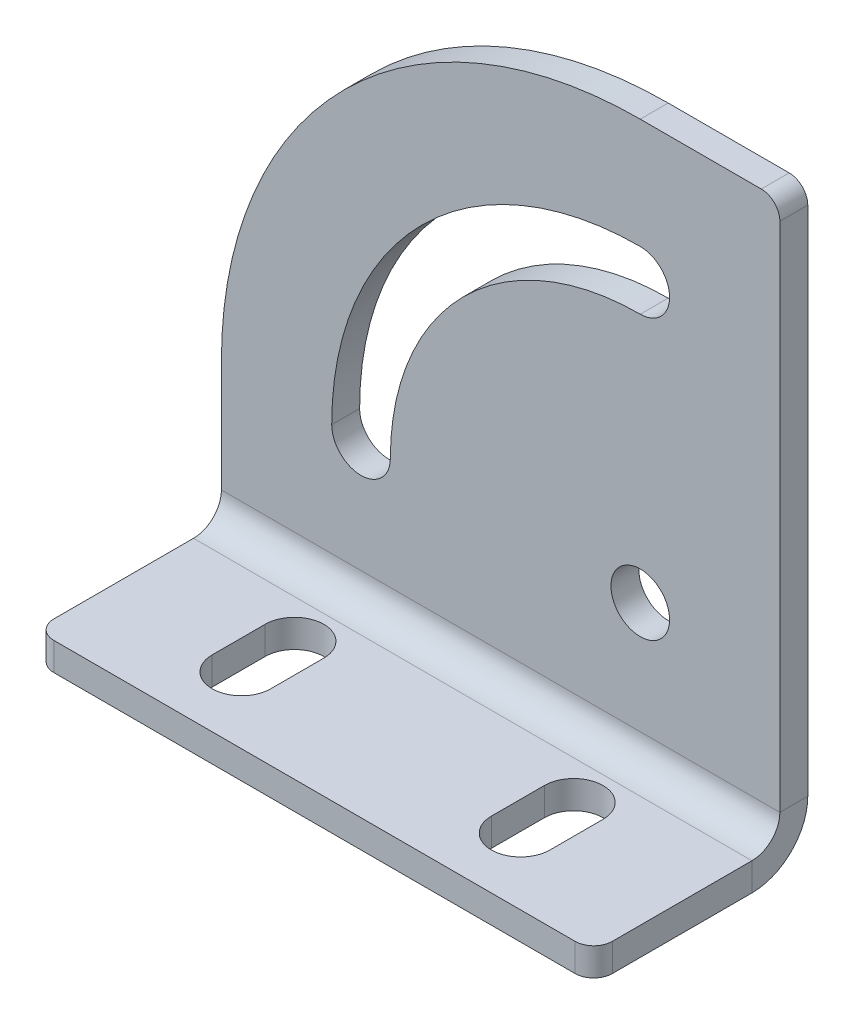
ISO-10303-21;
HEADER;
FILE_DESCRIPTION(('STEP AP214'),'2;1');
FILE_NAME('part.step','',(''),(''),'','','');
FILE_SCHEMA(('AUTOMOTIVE_DESIGN { 1 0 10303 214 1 1 1 1 }'));
ENDSEC;
DATA;
#1=APPLICATION_CONTEXT('core data for automotive mechanical design processes');
#2=APPLICATION_PROTOCOL_DEFINITION('international standard','automotive_design',2000,#1);
#3=PRODUCT_CONTEXT('',#1,'mechanical');
#4=PRODUCT('Part','Part','',(#3));
#5=PRODUCT_RELATED_PRODUCT_CATEGORY('part','',(#4));
#6=PRODUCT_DEFINITION_FORMATION('','',#4);
#7=PRODUCT_DEFINITION_CONTEXT('part definition',#1,'design');
#8=PRODUCT_DEFINITION('design','',#6,#7);
#9=PRODUCT_DEFINITION_SHAPE('','',#8);
#10=(LENGTH_UNIT() NAMED_UNIT(*) SI_UNIT(.MILLI.,.METRE.));
#11=(NAMED_UNIT(*) PLANE_ANGLE_UNIT() SI_UNIT($,.RADIAN.));
#12=(NAMED_UNIT(*) SI_UNIT($,.STERADIAN.) SOLID_ANGLE_UNIT());
#13=UNCERTAINTY_MEASURE_WITH_UNIT(LENGTH_MEASURE(1.E-05),#10,'distance_accuracy_value','');
#14=(GEOMETRIC_REPRESENTATION_CONTEXT(3) GLOBAL_UNCERTAINTY_ASSIGNED_CONTEXT((#13)) GLOBAL_UNIT_ASSIGNED_CONTEXT((#10,
#11,#12)) REPRESENTATION_CONTEXT('',''));
#15=CARTESIAN_POINT('',(0.,0.,0.));
#16=DIRECTION('',(0.,0.,1.));
#17=DIRECTION('',(1.,0.,0.));
#18=AXIS2_PLACEMENT_3D('',#15,#16,#17);
#19=CARTESIAN_POINT('',(-30.,0.,3.));
#20=DIRECTION('',(0.,0.,-1.));
#21=DIRECTION('',(-1.,0.,0.));
#22=AXIS2_PLACEMENT_3D('',#19,#20,#21);
#23=CYLINDRICAL_SURFACE('',#22,3.15);
#24=DIRECTION('',(0.,0.,1.));
#25=VECTOR('',#24,1.);
#26=CARTESIAN_POINT('',(-26.85,0.,3.));
#27=LINE('',#26,#25);
#28=CARTESIAN_POINT('',(-26.85,0.,0.));
#29=VERTEX_POINT('',#28);
#30=CARTESIAN_POINT('',(-26.85,0.,3.));
#31=VERTEX_POINT('',#30);
#32=EDGE_CURVE('E376',#29,#31,#27,.T.);
#33=ORIENTED_EDGE('',*,*,#32,.F.);
#34=CARTESIAN_POINT('',(-30.,0.,0.));
#35=DIRECTION('',(0.,0.,1.));
#36=DIRECTION('',(1.,0.,0.));
#37=AXIS2_PLACEMENT_3D('',#34,#35,#36);
#38=CIRCLE('',#37,3.15);
#39=CARTESIAN_POINT('',(-33.15,0.,0.));
#40=VERTEX_POINT('',#39);
#41=EDGE_CURVE('E333',#40,#29,#38,.T.);
#42=ORIENTED_EDGE('',*,*,#41,.F.);
#43=DIRECTION('',(0.,0.,1.));
#44=VECTOR('',#43,1.);
#45=CARTESIAN_POINT('',(-33.15,0.,3.));
#46=LINE('',#45,#44);
#47=CARTESIAN_POINT('',(-33.15,0.,3.));
#48=VERTEX_POINT('',#47);
#49=EDGE_CURVE('E374',#40,#48,#46,.T.);
#50=ORIENTED_EDGE('',*,*,#49,.T.);
#51=CARTESIAN_POINT('',(-30.,0.,3.));
#52=DIRECTION('',(0.,0.,1.));
#53=DIRECTION('',(1.,0.,0.));
#54=AXIS2_PLACEMENT_3D('',#51,#52,#53);
#55=CIRCLE('',#54,3.15);
#56=EDGE_CURVE('E203',#48,#31,#55,.T.);
#57=ORIENTED_EDGE('',*,*,#56,.T.);
#58=EDGE_LOOP('',(#33,#42,#50,#57));
#59=FACE_BOUND('',#58,.T.);
#60=ADVANCED_FACE('F16',(#59),#23,.F.);
#61=CARTESIAN_POINT('',(0.,0.,3.));
#62=DIRECTION('',(0.,0.,-1.));
#63=DIRECTION('',(-1.,0.,0.));
#64=AXIS2_PLACEMENT_3D('',#61,#62,#63);
#65=CYLINDRICAL_SURFACE('',#64,33.15);
#66=ORIENTED_EDGE('',*,*,#49,.F.);
#67=CARTESIAN_POINT('',(0.,0.,0.));
#68=DIRECTION('',(0.,0.,1.));
#69=DIRECTION('',(1.,0.,0.));
#70=AXIS2_PLACEMENT_3D('',#67,#68,#69);
#71=CIRCLE('',#70,33.15);
#72=CARTESIAN_POINT('',(0.,33.15,0.));
#73=VERTEX_POINT('',#72);
#74=EDGE_CURVE('E330',#73,#40,#71,.T.);
#75=ORIENTED_EDGE('',*,*,#74,.F.);
#76=DIRECTION('',(0.,0.,1.));
#77=VECTOR('',#76,1.);
#78=CARTESIAN_POINT('',(0.,33.15,3.));
#79=LINE('',#78,#77);
#80=CARTESIAN_POINT('',(0.,33.15,3.));
#81=VERTEX_POINT('',#80);
#82=EDGE_CURVE('E372',#73,#81,#79,.T.);
#83=ORIENTED_EDGE('',*,*,#82,.T.);
#84=CARTESIAN_POINT('',(0.,0.,3.));
#85=DIRECTION('',(0.,0.,1.));
#86=DIRECTION('',(1.,0.,0.));
#87=AXIS2_PLACEMENT_3D('',#84,#85,#86);
#88=CIRCLE('',#87,33.15);
#89=EDGE_CURVE('E206',#81,#48,#88,.T.);
#90=ORIENTED_EDGE('',*,*,#89,.T.);
#91=EDGE_LOOP('',(#66,#75,#83,#90));
#92=FACE_BOUND('',#91,.T.);
#93=ADVANCED_FACE('F432',(#92),#65,.F.);
#94=CARTESIAN_POINT('',(0.,30.,3.));
#95=DIRECTION('',(0.,0.,-1.));
#96=DIRECTION('',(-1.,0.,0.));
#97=AXIS2_PLACEMENT_3D('',#94,#95,#96);
#98=CYLINDRICAL_SURFACE('',#97,3.15);
#99=ORIENTED_EDGE('',*,*,#82,.F.);
#100=CARTESIAN_POINT('',(0.,30.,0.));
#101=DIRECTION('',(0.,0.,1.));
#102=DIRECTION('',(1.,0.,0.));
#103=AXIS2_PLACEMENT_3D('',#100,#101,#102);
#104=CIRCLE('',#103,3.15);
#105=CARTESIAN_POINT('',(0.,26.85,0.));
#106=VERTEX_POINT('',#105);
#107=EDGE_CURVE('E321',#106,#73,#104,.T.);
#108=ORIENTED_EDGE('',*,*,#107,.F.);
#109=DIRECTION('',(0.,0.,1.));
#110=VECTOR('',#109,1.);
#111=CARTESIAN_POINT('',(0.,26.85,3.));
#112=LINE('',#111,#110);
#113=CARTESIAN_POINT('',(0.,26.85,3.));
#114=VERTEX_POINT('',#113);
#115=EDGE_CURVE('E370',#106,#114,#112,.T.);
#116=ORIENTED_EDGE('',*,*,#115,.T.);
#117=CARTESIAN_POINT('',(0.,30.,3.));
#118=DIRECTION('',(0.,0.,1.));
#119=DIRECTION('',(1.,0.,0.));
#120=AXIS2_PLACEMENT_3D('',#117,#118,#119);
#121=CIRCLE('',#120,3.15);
#122=EDGE_CURVE('E194',#114,#81,#121,.T.);
#123=ORIENTED_EDGE('',*,*,#122,.T.);
#124=EDGE_LOOP('',(#99,#108,#116,#123));
#125=FACE_BOUND('',#124,.T.);
#126=ADVANCED_FACE('F438',(#125),#98,.F.);
#127=CARTESIAN_POINT('',(15.,-15.,3.));
#128=DIRECTION('',(-1.,0.,0.));
#129=DIRECTION('',(0.,1.,0.));
#130=AXIS2_PLACEMENT_3D('',#127,#128,#129);
#131=PLANE('',#130);
#132=DIRECTION('',(0.,1.,0.));
#133=VECTOR('',#132,1.);
#134=CARTESIAN_POINT('',(15.,0.,0.));
#135=LINE('',#134,#133);
#136=CARTESIAN_POINT('',(15.,-12.,0.));
#137=VERTEX_POINT('',#136);
#138=CARTESIAN_POINT('',(15.,43.,0.));
#139=VERTEX_POINT('',#138);
#140=EDGE_CURVE('E318',#137,#139,#135,.T.);
#141=ORIENTED_EDGE('',*,*,#140,.T.);
#142=DIRECTION('',(0.,0.,-1.));
#143=VECTOR('',#142,1.);
#144=CARTESIAN_POINT('',(15.,43.,3.));
#145=LINE('',#144,#143);
#146=CARTESIAN_POINT('',(15.,43.,3.));
#147=VERTEX_POINT('',#146);
#148=EDGE_CURVE('E378',#139,#147,#145,.F.);
#149=ORIENTED_EDGE('',*,*,#148,.T.);
#150=DIRECTION('',(0.,1.,0.));
#151=VECTOR('',#150,1.);
#152=CARTESIAN_POINT('',(15.,-15.,3.));
#153=LINE('',#152,#151);
#154=CARTESIAN_POINT('',(15.,-12.,3.));
#155=VERTEX_POINT('',#154);
#156=EDGE_CURVE('E181',#155,#147,#153,.T.);
#157=ORIENTED_EDGE('',*,*,#156,.F.);
#158=DIRECTION('',(0.,0.,1.));
#159=VECTOR('',#158,1.);
#160=CARTESIAN_POINT('',(15.,-12.,3.));
#161=LINE('',#160,#159);
#162=EDGE_CURVE('E190',#137,#155,#161,.T.);
#163=ORIENTED_EDGE('',*,*,#162,.F.);
#164=EDGE_LOOP('',(#141,#149,#157,#163));
#165=FACE_BOUND('',#164,.T.);
#166=ADVANCED_FACE('F385',(#165),#131,.F.);
#167=CARTESIAN_POINT('',(15.,45.,3.));
#168=DIRECTION('',(0.,-1.,0.));
#169=DIRECTION('',(-1.,0.,0.));
#170=AXIS2_PLACEMENT_3D('',#167,#168,#169);
#171=PLANE('',#170);
#172=DIRECTION('',(-1.,0.,0.));
#173=VECTOR('',#172,1.);
#174=CARTESIAN_POINT('',(15.,45.,3.));
#175=LINE('',#174,#173);
#176=CARTESIAN_POINT('',(13.,45.,3.));
#177=VERTEX_POINT('',#176);
#178=CARTESIAN_POINT('',(1.98625837999344E-13,45.,3.));
#179=VERTEX_POINT('',#178);
#180=EDGE_CURVE('E173',#177,#179,#175,.T.);
#181=ORIENTED_EDGE('',*,*,#180,.F.);
#182=DIRECTION('',(0.,0.,-1.));
#183=VECTOR('',#182,1.);
#184=CARTESIAN_POINT('',(13.,45.,3.));
#185=LINE('',#184,#183);
#186=CARTESIAN_POINT('',(13.,45.,0.));
#187=VERTEX_POINT('',#186);
#188=EDGE_CURVE('E24',#177,#187,#185,.T.);
#189=ORIENTED_EDGE('',*,*,#188,.T.);
#190=DIRECTION('',(-1.,0.,0.));
#191=VECTOR('',#190,1.);
#192=CARTESIAN_POINT('',(0.,45.,0.));
#193=LINE('',#192,#191);
#194=CARTESIAN_POINT('',(1.98625837999344E-13,45.,0.));
#195=VERTEX_POINT('',#194);
#196=EDGE_CURVE('E186',#187,#195,#193,.T.);
#197=ORIENTED_EDGE('',*,*,#196,.T.);
#198=DIRECTION('',(0.,0.,1.));
#199=VECTOR('',#198,1.);
#200=CARTESIAN_POINT('',(1.98625837999344E-13,45.,3.));
#201=LINE('',#200,#199);
#202=EDGE_CURVE('E184',#195,#179,#201,.T.);
#203=ORIENTED_EDGE('',*,*,#202,.T.);
#204=EDGE_LOOP('',(#181,#189,#197,#203));
#205=FACE_BOUND('',#204,.T.);
#206=ADVANCED_FACE('F185',(#205),#171,.F.);
#207=CARTESIAN_POINT('',(0.,0.,3.));
#208=DIRECTION('',(0.,0.,-1.));
#209=DIRECTION('',(-1.,0.,0.));
#210=AXIS2_PLACEMENT_3D('',#207,#208,#209);
#211=CYLINDRICAL_SURFACE('',#210,45.);
#212=ORIENTED_EDGE('',*,*,#202,.F.);
#213=CARTESIAN_POINT('',(0.,0.,0.));
#214=DIRECTION('',(0.,0.,1.));
#215=DIRECTION('',(1.,0.,0.));
#216=AXIS2_PLACEMENT_3D('',#213,#214,#215);
#217=CIRCLE('',#216,45.);
#218=CARTESIAN_POINT('',(-45.,0.,0.));
#219=VERTEX_POINT('',#218);
#220=EDGE_CURVE('E319',#195,#219,#217,.T.);
#221=ORIENTED_EDGE('',*,*,#220,.T.);
#222=DIRECTION('',(0.,0.,1.));
#223=VECTOR('',#222,1.);
#224=CARTESIAN_POINT('',(-45.,0.,3.));
#225=LINE('',#224,#223);
#226=CARTESIAN_POINT('',(-45.,0.,3.));
#227=VERTEX_POINT('',#226);
#228=EDGE_CURVE('E191',#219,#227,#225,.T.);
#229=ORIENTED_EDGE('',*,*,#228,.T.);
#230=CARTESIAN_POINT('',(0.,0.,3.));
#231=DIRECTION('',(0.,0.,1.));
#232=DIRECTION('',(-1.,0.,0.));
#233=AXIS2_PLACEMENT_3D('',#230,#231,#232);
#234=CIRCLE('',#233,45.);
#235=EDGE_CURVE('E179',#179,#227,#234,.T.);
#236=ORIENTED_EDGE('',*,*,#235,.F.);
#237=EDGE_LOOP('',(#212,#221,#229,#236));
#238=FACE_BOUND('',#237,.T.);
#239=ADVANCED_FACE('F193',(#238),#211,.T.);
#240=CARTESIAN_POINT('',(-45.,-15.,3.));
#241=DIRECTION('',(1.,0.,0.));
#242=DIRECTION('',(0.,-1.,0.));
#243=AXIS2_PLACEMENT_3D('',#240,#241,#242);
#244=PLANE('',#243);
#245=ORIENTED_EDGE('',*,*,#228,.F.);
#246=DIRECTION('',(0.,1.,0.));
#247=VECTOR('',#246,1.);
#248=CARTESIAN_POINT('',(-45.,0.,0.));
#249=LINE('',#248,#247);
#250=CARTESIAN_POINT('',(-45.,-12.,0.));
#251=VERTEX_POINT('',#250);
#252=EDGE_CURVE('E314',#219,#251,#249,.F.);
#253=ORIENTED_EDGE('',*,*,#252,.T.);
#254=DIRECTION('',(0.,0.,1.));
#255=VECTOR('',#254,1.);
#256=CARTESIAN_POINT('',(-45.,-12.,3.));
#257=LINE('',#256,#255);
#258=CARTESIAN_POINT('',(-45.,-12.,3.));
#259=VERTEX_POINT('',#258);
#260=EDGE_CURVE('E366',#251,#259,#257,.T.);
#261=ORIENTED_EDGE('',*,*,#260,.T.);
#262=DIRECTION('',(0.,-1.,0.));
#263=VECTOR('',#262,1.);
#264=CARTESIAN_POINT('',(-45.,-15.,3.));
#265=LINE('',#264,#263);
#266=EDGE_CURVE('E265',#227,#259,#265,.T.);
#267=ORIENTED_EDGE('',*,*,#266,.F.);
#268=EDGE_LOOP('',(#245,#253,#261,#267));
#269=FACE_BOUND('',#268,.T.);
#270=ADVANCED_FACE('F516',(#269),#244,.F.);
#271=CARTESIAN_POINT('',(-45.,-12.,6.));
#272=DIRECTION('',(1.,0.,0.));
#273=DIRECTION('',(0.,0.,-1.));
#274=AXIS2_PLACEMENT_3D('',#271,#272,#273);
#275=PLANE('',#274);
#276=ORIENTED_EDGE('',*,*,#260,.F.);
#277=CARTESIAN_POINT('',(-45.,-12.,6.));
#278=DIRECTION('',(1.,0.,0.));
#279=DIRECTION('',(0.,0.,-1.));
#280=AXIS2_PLACEMENT_3D('',#277,#278,#279);
#281=CIRCLE('',#280,6.);
#282=CARTESIAN_POINT('',(-45.,-18.,6.));
#283=VERTEX_POINT('',#282);
#284=EDGE_CURVE('E311',#251,#283,#281,.F.);
#285=ORIENTED_EDGE('',*,*,#284,.T.);
#286=DIRECTION('',(0.,1.,0.));
#287=VECTOR('',#286,1.);
#288=CARTESIAN_POINT('',(-45.,-15.,6.));
#289=LINE('',#288,#287);
#290=CARTESIAN_POINT('',(-45.,-15.,6.));
#291=VERTEX_POINT('',#290);
#292=EDGE_CURVE('E364',#283,#291,#289,.T.);
#293=ORIENTED_EDGE('',*,*,#292,.T.);
#294=CARTESIAN_POINT('',(-45.,-12.,6.));
#295=DIRECTION('',(-1.,0.,0.));
#296=DIRECTION('',(0.,0.,1.));
#297=AXIS2_PLACEMENT_3D('',#294,#295,#296);
#298=CIRCLE('',#297,3.);
#299=EDGE_CURVE('E261',#259,#291,#298,.T.);
#300=ORIENTED_EDGE('',*,*,#299,.F.);
#301=EDGE_LOOP('',(#276,#285,#293,#300));
#302=FACE_BOUND('',#301,.T.);
#303=ADVANCED_FACE('F394',(#302),#275,.F.);
#304=CARTESIAN_POINT('',(-45.,-15.,23.));
#305=DIRECTION('',(1.,0.,0.));
#306=DIRECTION('',(0.,0.,-1.));
#307=AXIS2_PLACEMENT_3D('',#304,#305,#306);
#308=PLANE('',#307);
#309=ORIENTED_EDGE('',*,*,#292,.F.);
#310=DIRECTION('',(0.,0.,1.));
#311=VECTOR('',#310,1.);
#312=CARTESIAN_POINT('',(-45.,-18.,23.));
#313=LINE('',#312,#311);
#314=CARTESIAN_POINT('',(-45.,-18.,21.));
#315=VERTEX_POINT('',#314);
#316=EDGE_CURVE('E292',#315,#283,#313,.F.);
#317=ORIENTED_EDGE('',*,*,#316,.F.);
#318=DIRECTION('',(0.,1.,0.));
#319=VECTOR('',#318,1.);
#320=CARTESIAN_POINT('',(-45.,-15.,21.));
#321=LINE('',#320,#319);
#322=CARTESIAN_POINT('',(-45.,-15.,21.));
#323=VERTEX_POINT('',#322);
#324=EDGE_CURVE('E362',#315,#323,#321,.T.);
#325=ORIENTED_EDGE('',*,*,#324,.T.);
#326=DIRECTION('',(0.,0.,-1.));
#327=VECTOR('',#326,1.);
#328=CARTESIAN_POINT('',(-45.,-15.,23.));
#329=LINE('',#328,#327);
#330=EDGE_CURVE('E236',#323,#291,#329,.T.);
#331=ORIENTED_EDGE('',*,*,#330,.T.);
#332=EDGE_LOOP('',(#309,#317,#325,#331));
#333=FACE_BOUND('',#332,.T.);
#334=ADVANCED_FACE('F509',(#333),#308,.F.);
#335=CARTESIAN_POINT('',(-43.,-15.,21.));
#336=DIRECTION('',(0.,1.,0.));
#337=DIRECTION('',(0.,0.,1.));
#338=AXIS2_PLACEMENT_3D('',#335,#336,#337);
#339=CYLINDRICAL_SURFACE('',#338,2.);
#340=ORIENTED_EDGE('',*,*,#324,.F.);
#341=CARTESIAN_POINT('',(-43.,-18.,21.));
#342=DIRECTION('',(0.,1.,0.));
#343=DIRECTION('',(0.,0.,1.));
#344=AXIS2_PLACEMENT_3D('',#341,#342,#343);
#345=CIRCLE('',#344,2.);
#346=CARTESIAN_POINT('',(-43.,-18.,23.));
#347=VERTEX_POINT('',#346);
#348=EDGE_CURVE('E306',#315,#347,#345,.T.);
#349=ORIENTED_EDGE('',*,*,#348,.T.);
#350=DIRECTION('',(0.,1.,0.));
#351=VECTOR('',#350,1.);
#352=CARTESIAN_POINT('',(-43.,-15.,23.));
#353=LINE('',#352,#351);
#354=CARTESIAN_POINT('',(-43.,-15.,23.));
#355=VERTEX_POINT('',#354);
#356=EDGE_CURVE('E360',#347,#355,#353,.T.);
#357=ORIENTED_EDGE('',*,*,#356,.T.);
#358=CARTESIAN_POINT('',(-43.,-15.,21.));
#359=DIRECTION('',(0.,1.,0.));
#360=DIRECTION('',(0.,0.,1.));
#361=AXIS2_PLACEMENT_3D('',#358,#359,#360);
#362=CIRCLE('',#361,2.);
#363=EDGE_CURVE('E239',#323,#355,#362,.T.);
#364=ORIENTED_EDGE('',*,*,#363,.F.);
#365=EDGE_LOOP('',(#340,#349,#357,#364));
#366=FACE_BOUND('',#365,.T.);
#367=ADVANCED_FACE('F505',(#366),#339,.T.);
#368=CARTESIAN_POINT('',(0.,-15.,23.));
#369=DIRECTION('',(0.,0.,1.));
#370=DIRECTION('',(1.,0.,0.));
#371=AXIS2_PLACEMENT_3D('',#368,#369,#370);
#372=PLANE('',#371);
#373=ORIENTED_EDGE('',*,*,#356,.F.);
#374=DIRECTION('',(1.,0.,0.));
#375=VECTOR('',#374,1.);
#376=CARTESIAN_POINT('',(0.,-18.,23.));
#377=LINE('',#376,#375);
#378=CARTESIAN_POINT('',(13.,-18.,23.));
#379=VERTEX_POINT('',#378);
#380=EDGE_CURVE('E303',#347,#379,#377,.T.);
#381=ORIENTED_EDGE('',*,*,#380,.T.);
#382=DIRECTION('',(0.,1.,0.));
#383=VECTOR('',#382,1.);
#384=CARTESIAN_POINT('',(13.,-15.,23.));
#385=LINE('',#384,#383);
#386=CARTESIAN_POINT('',(13.,-15.,23.));
#387=VERTEX_POINT('',#386);
#388=EDGE_CURVE('E358',#379,#387,#385,.T.);
#389=ORIENTED_EDGE('',*,*,#388,.T.);
#390=DIRECTION('',(1.,0.,0.));
#391=VECTOR('',#390,1.);
#392=CARTESIAN_POINT('',(0.,-15.,23.));
#393=LINE('',#392,#391);
#394=EDGE_CURVE('E242',#355,#387,#393,.T.);
#395=ORIENTED_EDGE('',*,*,#394,.F.);
#396=EDGE_LOOP('',(#373,#381,#389,#395));
#397=FACE_BOUND('',#396,.T.);
#398=ADVANCED_FACE('F501',(#397),#372,.T.);
#399=CARTESIAN_POINT('',(13.,-15.,21.));
#400=DIRECTION('',(0.,1.,0.));
#401=DIRECTION('',(0.,0.,1.));
#402=AXIS2_PLACEMENT_3D('',#399,#400,#401);
#403=CYLINDRICAL_SURFACE('',#402,2.);
#404=ORIENTED_EDGE('',*,*,#388,.F.);
#405=CARTESIAN_POINT('',(13.,-18.,21.));
#406=DIRECTION('',(0.,1.,0.));
#407=DIRECTION('',(0.,0.,1.));
#408=AXIS2_PLACEMENT_3D('',#405,#406,#407);
#409=CIRCLE('',#408,2.);
#410=CARTESIAN_POINT('',(15.,-18.,21.));
#411=VERTEX_POINT('',#410);
#412=EDGE_CURVE('E300',#379,#411,#409,.T.);
#413=ORIENTED_EDGE('',*,*,#412,.T.);
#414=DIRECTION('',(0.,1.,0.));
#415=VECTOR('',#414,1.);
#416=CARTESIAN_POINT('',(15.,-15.,21.));
#417=LINE('',#416,#415);
#418=CARTESIAN_POINT('',(15.,-15.,21.));
#419=VERTEX_POINT('',#418);
#420=EDGE_CURVE('E356',#411,#419,#417,.T.);
#421=ORIENTED_EDGE('',*,*,#420,.T.);
#422=CARTESIAN_POINT('',(13.,-15.,21.));
#423=DIRECTION('',(0.,1.,0.));
#424=DIRECTION('',(0.,0.,1.));
#425=AXIS2_PLACEMENT_3D('',#422,#423,#424);
#426=CIRCLE('',#425,2.);
#427=EDGE_CURVE('E245',#387,#419,#426,.T.);
#428=ORIENTED_EDGE('',*,*,#427,.F.);
#429=EDGE_LOOP('',(#404,#413,#421,#428));
#430=FACE_BOUND('',#429,.T.);
#431=ADVANCED_FACE('F498',(#430),#403,.T.);
#432=CARTESIAN_POINT('',(15.,-15.,23.));
#433=DIRECTION('',(1.,0.,0.));
#434=DIRECTION('',(0.,0.,-1.));
#435=AXIS2_PLACEMENT_3D('',#432,#433,#434);
#436=PLANE('',#435);
#437=ORIENTED_EDGE('',*,*,#420,.F.);
#438=DIRECTION('',(0.,0.,1.));
#439=VECTOR('',#438,1.);
#440=CARTESIAN_POINT('',(15.,-18.,23.));
#441=LINE('',#440,#439);
#442=CARTESIAN_POINT('',(15.,-18.,6.));
#443=VERTEX_POINT('',#442);
#444=EDGE_CURVE('E271',#411,#443,#441,.F.);
#445=ORIENTED_EDGE('',*,*,#444,.T.);
#446=DIRECTION('',(0.,1.,0.));
#447=VECTOR('',#446,1.);
#448=CARTESIAN_POINT('',(15.,-15.,6.));
#449=LINE('',#448,#447);
#450=CARTESIAN_POINT('',(15.,-15.,6.));
#451=VERTEX_POINT('',#450);
#452=EDGE_CURVE('E354',#443,#451,#449,.T.);
#453=ORIENTED_EDGE('',*,*,#452,.T.);
#454=DIRECTION('',(0.,0.,-1.));
#455=VECTOR('',#454,1.);
#456=CARTESIAN_POINT('',(15.,-15.,23.));
#457=LINE('',#456,#455);
#458=EDGE_CURVE('E248',#419,#451,#457,.T.);
#459=ORIENTED_EDGE('',*,*,#458,.F.);
#460=EDGE_LOOP('',(#437,#445,#453,#459));
#461=FACE_BOUND('',#460,.T.);
#462=ADVANCED_FACE('F409',(#461),#436,.T.);
#463=CARTESIAN_POINT('',(0.,-15.,15.85));
#464=DIRECTION('',(0.,1.,0.));
#465=DIRECTION('',(0.,0.,1.));
#466=AXIS2_PLACEMENT_3D('',#463,#464,#465);
#467=CYLINDRICAL_SURFACE('',#466,3.15);
#468=DIRECTION('',(0.,1.,0.));
#469=VECTOR('',#468,1.);
#470=CARTESIAN_POINT('',(3.15,-15.,15.85));
#471=LINE('',#470,#469);
#472=CARTESIAN_POINT('',(3.15,-18.,15.85));
#473=VERTEX_POINT('',#472);
#474=CARTESIAN_POINT('',(3.15,-15.,15.85));
#475=VERTEX_POINT('',#474);
#476=EDGE_CURVE('E352',#473,#475,#471,.T.);
#477=ORIENTED_EDGE('',*,*,#476,.F.);
#478=CARTESIAN_POINT('',(0.,-18.,15.85));
#479=DIRECTION('',(0.,1.,0.));
#480=DIRECTION('',(0.,0.,1.));
#481=AXIS2_PLACEMENT_3D('',#478,#479,#480);
#482=CIRCLE('',#481,3.15);
#483=CARTESIAN_POINT('',(-3.15,-18.,15.85));
#484=VERTEX_POINT('',#483);
#485=EDGE_CURVE('E293',#484,#473,#482,.T.);
#486=ORIENTED_EDGE('',*,*,#485,.F.);
#487=DIRECTION('',(0.,1.,0.));
#488=VECTOR('',#487,1.);
#489=CARTESIAN_POINT('',(-3.15,-15.,15.85));
#490=LINE('',#489,#488);
#491=CARTESIAN_POINT('',(-3.15,-15.,15.85));
#492=VERTEX_POINT('',#491);
#493=EDGE_CURVE('E350',#484,#492,#490,.T.);
#494=ORIENTED_EDGE('',*,*,#493,.T.);
#495=CARTESIAN_POINT('',(0.,-15.,15.85));
#496=DIRECTION('',(0.,1.,0.));
#497=DIRECTION('',(0.,0.,1.));
#498=AXIS2_PLACEMENT_3D('',#495,#496,#497);
#499=CIRCLE('',#498,3.15);
#500=EDGE_CURVE('E230',#492,#475,#499,.T.);
#501=ORIENTED_EDGE('',*,*,#500,.T.);
#502=EDGE_LOOP('',(#477,#486,#494,#501));
#503=FACE_BOUND('',#502,.T.);
#504=ADVANCED_FACE('F488',(#503),#467,.F.);
#505=CARTESIAN_POINT('',(-3.15,-15.,10.15));
#506=DIRECTION('',(-1.,0.,0.));
#507=DIRECTION('',(0.,0.,1.));
#508=AXIS2_PLACEMENT_3D('',#505,#506,#507);
#509=PLANE('',#508);
#510=ORIENTED_EDGE('',*,*,#493,.F.);
#511=DIRECTION('',(0.,0.,1.));
#512=VECTOR('',#511,1.);
#513=CARTESIAN_POINT('',(-3.15,-18.,23.));
#514=LINE('',#513,#512);
#515=CARTESIAN_POINT('',(-3.15,-18.,10.15));
#516=VERTEX_POINT('',#515);
#517=EDGE_CURVE('E289',#516,#484,#514,.T.);
#518=ORIENTED_EDGE('',*,*,#517,.F.);
#519=DIRECTION('',(0.,1.,0.));
#520=VECTOR('',#519,1.);
#521=CARTESIAN_POINT('',(-3.15,-15.,10.15));
#522=LINE('',#521,#520);
#523=CARTESIAN_POINT('',(-3.15,-15.,10.15));
#524=VERTEX_POINT('',#523);
#525=EDGE_CURVE('E348',#516,#524,#522,.T.);
#526=ORIENTED_EDGE('',*,*,#525,.T.);
#527=DIRECTION('',(0.,0.,1.));
#528=VECTOR('',#527,1.);
#529=CARTESIAN_POINT('',(-3.15,-15.,10.15));
#530=LINE('',#529,#528);
#531=EDGE_CURVE('E233',#524,#492,#530,.T.);
#532=ORIENTED_EDGE('',*,*,#531,.T.);
#533=EDGE_LOOP('',(#510,#518,#526,#532));
#534=FACE_BOUND('',#533,.T.);
#535=ADVANCED_FACE('F484',(#534),#509,.F.);
#536=CARTESIAN_POINT('',(0.,-15.,10.15));
#537=DIRECTION('',(0.,1.,0.));
#538=DIRECTION('',(0.,0.,1.));
#539=AXIS2_PLACEMENT_3D('',#536,#537,#538);
#540=CYLINDRICAL_SURFACE('',#539,3.15);
#541=ORIENTED_EDGE('',*,*,#525,.F.);
#542=CARTESIAN_POINT('',(0.,-18.,10.15));
#543=DIRECTION('',(0.,1.,0.));
#544=DIRECTION('',(0.,0.,1.));
#545=AXIS2_PLACEMENT_3D('',#542,#543,#544);
#546=CIRCLE('',#545,3.15);
#547=CARTESIAN_POINT('',(3.15,-18.,10.15));
#548=VERTEX_POINT('',#547);
#549=EDGE_CURVE('E280',#548,#516,#546,.T.);
#550=ORIENTED_EDGE('',*,*,#549,.F.);
#551=DIRECTION('',(0.,1.,0.));
#552=VECTOR('',#551,1.);
#553=CARTESIAN_POINT('',(3.15,-15.,10.15));
#554=LINE('',#553,#552);
#555=CARTESIAN_POINT('',(3.15,-15.,10.15));
#556=VERTEX_POINT('',#555);
#557=EDGE_CURVE('E346',#548,#556,#554,.T.);
#558=ORIENTED_EDGE('',*,*,#557,.T.);
#559=CARTESIAN_POINT('',(0.,-15.,10.15));
#560=DIRECTION('',(0.,1.,0.));
#561=DIRECTION('',(0.,0.,1.));
#562=AXIS2_PLACEMENT_3D('',#559,#560,#561);
#563=CIRCLE('',#562,3.15);
#564=EDGE_CURVE('E224',#556,#524,#563,.T.);
#565=ORIENTED_EDGE('',*,*,#564,.T.);
#566=EDGE_LOOP('',(#541,#550,#558,#565));
#567=FACE_BOUND('',#566,.T.);
#568=ADVANCED_FACE('F479',(#567),#540,.F.);
#569=CARTESIAN_POINT('',(-30.,-15.,15.85));
#570=DIRECTION('',(0.,1.,0.));
#571=DIRECTION('',(0.,0.,1.));
#572=AXIS2_PLACEMENT_3D('',#569,#570,#571);
#573=CYLINDRICAL_SURFACE('',#572,3.15);
#574=DIRECTION('',(0.,1.,0.));
#575=VECTOR('',#574,1.);
#576=CARTESIAN_POINT('',(-26.85,-15.,15.85));
#577=LINE('',#576,#575);
#578=CARTESIAN_POINT('',(-26.85,-18.,15.85));
#579=VERTEX_POINT('',#578);
#580=CARTESIAN_POINT('',(-26.85,-15.,15.85));
#581=VERTEX_POINT('',#580);
#582=EDGE_CURVE('E344',#579,#581,#577,.T.);
#583=ORIENTED_EDGE('',*,*,#582,.F.);
#584=CARTESIAN_POINT('',(-30.,-18.,15.85));
#585=DIRECTION('',(0.,1.,0.));
#586=DIRECTION('',(0.,0.,1.));
#587=AXIS2_PLACEMENT_3D('',#584,#585,#586);
#588=CIRCLE('',#587,3.15);
#589=CARTESIAN_POINT('',(-33.15,-18.,15.85));
#590=VERTEX_POINT('',#589);
#591=EDGE_CURVE('E281',#590,#579,#588,.T.);
#592=ORIENTED_EDGE('',*,*,#591,.F.);
#593=DIRECTION('',(0.,1.,0.));
#594=VECTOR('',#593,1.);
#595=CARTESIAN_POINT('',(-33.15,-15.,15.85));
#596=LINE('',#595,#594);
#597=CARTESIAN_POINT('',(-33.15,-15.,15.85));
#598=VERTEX_POINT('',#597);
#599=EDGE_CURVE('E342',#590,#598,#596,.T.);
#600=ORIENTED_EDGE('',*,*,#599,.T.);
#601=CARTESIAN_POINT('',(-30.,-15.,15.85));
#602=DIRECTION('',(0.,1.,0.));
#603=DIRECTION('',(0.,0.,1.));
#604=AXIS2_PLACEMENT_3D('',#601,#602,#603);
#605=CIRCLE('',#604,3.15);
#606=EDGE_CURVE('E218',#598,#581,#605,.T.);
#607=ORIENTED_EDGE('',*,*,#606,.T.);
#608=EDGE_LOOP('',(#583,#592,#600,#607));
#609=FACE_BOUND('',#608,.T.);
#610=ADVANCED_FACE('F476',(#609),#573,.F.);
#611=CARTESIAN_POINT('',(-33.15,-15.,10.15));
#612=DIRECTION('',(-1.,0.,0.));
#613=DIRECTION('',(0.,0.,1.));
#614=AXIS2_PLACEMENT_3D('',#611,#612,#613);
#615=PLANE('',#614);
#616=ORIENTED_EDGE('',*,*,#599,.F.);
#617=DIRECTION('',(0.,0.,1.));
#618=VECTOR('',#617,1.);
#619=CARTESIAN_POINT('',(-33.15,-18.,23.));
#620=LINE('',#619,#618);
#621=CARTESIAN_POINT('',(-33.15,-18.,10.15));
#622=VERTEX_POINT('',#621);
#623=EDGE_CURVE('E277',#622,#590,#620,.T.);
#624=ORIENTED_EDGE('',*,*,#623,.F.);
#625=DIRECTION('',(0.,1.,0.));
#626=VECTOR('',#625,1.);
#627=CARTESIAN_POINT('',(-33.15,-15.,10.15));
#628=LINE('',#627,#626);
#629=CARTESIAN_POINT('',(-33.15,-15.,10.15));
#630=VERTEX_POINT('',#629);
#631=EDGE_CURVE('E340',#622,#630,#628,.T.);
#632=ORIENTED_EDGE('',*,*,#631,.T.);
#633=DIRECTION('',(0.,0.,1.));
#634=VECTOR('',#633,1.);
#635=CARTESIAN_POINT('',(-33.15,-15.,10.15));
#636=LINE('',#635,#634);
#637=EDGE_CURVE('E221',#630,#598,#636,.T.);
#638=ORIENTED_EDGE('',*,*,#637,.T.);
#639=EDGE_LOOP('',(#616,#624,#632,#638));
#640=FACE_BOUND('',#639,.T.);
#641=ADVANCED_FACE('F472',(#640),#615,.F.);
#642=CARTESIAN_POINT('',(-30.,-15.,10.15));
#643=DIRECTION('',(0.,1.,0.));
#644=DIRECTION('',(0.,0.,1.));
#645=AXIS2_PLACEMENT_3D('',#642,#643,#644);
#646=CYLINDRICAL_SURFACE('',#645,3.15);
#647=ORIENTED_EDGE('',*,*,#631,.F.);
#648=CARTESIAN_POINT('',(-30.,-18.,10.15));
#649=DIRECTION('',(0.,1.,0.));
#650=DIRECTION('',(0.,0.,1.));
#651=AXIS2_PLACEMENT_3D('',#648,#649,#650);
#652=CIRCLE('',#651,3.15);
#653=CARTESIAN_POINT('',(-26.85,-18.,10.15));
#654=VERTEX_POINT('',#653);
#655=EDGE_CURVE('E272',#654,#622,#652,.T.);
#656=ORIENTED_EDGE('',*,*,#655,.F.);
#657=DIRECTION('',(0.,1.,0.));
#658=VECTOR('',#657,1.);
#659=CARTESIAN_POINT('',(-26.85,-15.,10.15));
#660=LINE('',#659,#658);
#661=CARTESIAN_POINT('',(-26.85,-15.,10.15));
#662=VERTEX_POINT('',#661);
#663=EDGE_CURVE('E257',#654,#662,#660,.T.);
#664=ORIENTED_EDGE('',*,*,#663,.T.);
#665=CARTESIAN_POINT('',(-30.,-15.,10.15));
#666=DIRECTION('',(0.,1.,0.));
#667=DIRECTION('',(0.,0.,1.));
#668=AXIS2_PLACEMENT_3D('',#665,#666,#667);
#669=CIRCLE('',#668,3.15);
#670=EDGE_CURVE('E212',#662,#630,#669,.T.);
#671=ORIENTED_EDGE('',*,*,#670,.T.);
#672=EDGE_LOOP('',(#647,#656,#664,#671));
#673=FACE_BOUND('',#672,.T.);
#674=ADVANCED_FACE('F446',(#673),#646,.F.);
#675=CARTESIAN_POINT('',(0.,0.,3.));
#676=DIRECTION('',(0.,0.,-1.));
#677=DIRECTION('',(-1.,0.,0.));
#678=AXIS2_PLACEMENT_3D('',#675,#676,#677);
#679=CYLINDRICAL_SURFACE('',#678,26.85);
#680=CARTESIAN_POINT('',(0.,0.,0.));
#681=DIRECTION('',(0.,0.,-1.));
#682=DIRECTION('',(-1.,0.,0.));
#683=AXIS2_PLACEMENT_3D('',#680,#681,#682);
#684=CIRCLE('',#683,26.85);
#685=EDGE_CURVE('E329',#29,#106,#684,.T.);
#686=ORIENTED_EDGE('',*,*,#685,.F.);
#687=ORIENTED_EDGE('',*,*,#32,.T.);
#688=CARTESIAN_POINT('',(0.,0.,3.));
#689=DIRECTION('',(0.,0.,-1.));
#690=DIRECTION('',(1.,0.,0.));
#691=AXIS2_PLACEMENT_3D('',#688,#689,#690);
#692=CIRCLE('',#691,26.85);
#693=EDGE_CURVE('E197',#31,#114,#692,.T.);
#694=ORIENTED_EDGE('',*,*,#693,.T.);
#695=ORIENTED_EDGE('',*,*,#115,.F.);
#696=EDGE_LOOP('',(#686,#687,#694,#695));
#697=FACE_BOUND('',#696,.T.);
#698=ADVANCED_FACE('F443',(#697),#679,.T.);
#699=CARTESIAN_POINT('',(0.,0.,3.));
#700=DIRECTION('',(0.,0.,-1.));
#701=DIRECTION('',(-1.,0.,0.));
#702=AXIS2_PLACEMENT_3D('',#699,#700,#701);
#703=CYLINDRICAL_SURFACE('',#702,3.15);
#704=CARTESIAN_POINT('',(0.,0.,3.));
#705=DIRECTION('',(0.,0.,1.));
#706=DIRECTION('',(1.,0.,0.));
#707=AXIS2_PLACEMENT_3D('',#704,#705,#706);
#708=CIRCLE('',#707,3.15);
#709=CARTESIAN_POINT('',(3.15,0.,3.));
#710=VERTEX_POINT('',#709);
#711=EDGE_CURVE('E209',#710,#710,#708,.T.);
#712=ORIENTED_EDGE('',*,*,#711,.T.);
#713=EDGE_LOOP('',(#712));
#714=FACE_BOUND('',#713,.T.);
#715=CARTESIAN_POINT('',(0.,0.,0.));
#716=DIRECTION('',(0.,0.,1.));
#717=DIRECTION('',(1.,0.,0.));
#718=AXIS2_PLACEMENT_3D('',#715,#716,#717);
#719=CIRCLE('',#718,3.15);
#720=CARTESIAN_POINT('',(3.15,0.,0.));
#721=VERTEX_POINT('',#720);
#722=EDGE_CURVE('E276',#721,#721,#719,.T.);
#723=ORIENTED_EDGE('',*,*,#722,.F.);
#724=EDGE_LOOP('',(#723));
#725=FACE_BOUND('',#724,.T.);
#726=ADVANCED_FACE('F445',(#714,#725),#703,.F.);
#727=CARTESIAN_POINT('',(-26.85,-15.,10.15));
#728=DIRECTION('',(1.,0.,0.));
#729=DIRECTION('',(0.,0.,-1.));
#730=AXIS2_PLACEMENT_3D('',#727,#728,#729);
#731=PLANE('',#730);
#732=DIRECTION('',(0.,0.,1.));
#733=VECTOR('',#732,1.);
#734=CARTESIAN_POINT('',(-26.85,-18.,23.));
#735=LINE('',#734,#733);
#736=EDGE_CURVE('E275',#579,#654,#735,.F.);
#737=ORIENTED_EDGE('',*,*,#736,.F.);
#738=ORIENTED_EDGE('',*,*,#582,.T.);
#739=DIRECTION('',(0.,0.,-1.));
#740=VECTOR('',#739,1.);
#741=CARTESIAN_POINT('',(-26.85,-15.,10.15));
#742=LINE('',#741,#740);
#743=EDGE_CURVE('E215',#581,#662,#742,.T.);
#744=ORIENTED_EDGE('',*,*,#743,.T.);
#745=ORIENTED_EDGE('',*,*,#663,.F.);
#746=EDGE_LOOP('',(#737,#738,#744,#745));
#747=FACE_BOUND('',#746,.T.);
#748=ADVANCED_FACE('F449',(#747),#731,.F.);
#749=CARTESIAN_POINT('',(3.15,-15.,10.15));
#750=DIRECTION('',(1.,0.,0.));
#751=DIRECTION('',(0.,0.,-1.));
#752=AXIS2_PLACEMENT_3D('',#749,#750,#751);
#753=PLANE('',#752);
#754=DIRECTION('',(0.,0.,1.));
#755=VECTOR('',#754,1.);
#756=CARTESIAN_POINT('',(3.15,-18.,23.));
#757=LINE('',#756,#755);
#758=EDGE_CURVE('E288',#473,#548,#757,.F.);
#759=ORIENTED_EDGE('',*,*,#758,.F.);
#760=ORIENTED_EDGE('',*,*,#476,.T.);
#761=DIRECTION('',(0.,0.,-1.));
#762=VECTOR('',#761,1.);
#763=CARTESIAN_POINT('',(3.15,-15.,10.15));
#764=LINE('',#763,#762);
#765=EDGE_CURVE('E227',#475,#556,#764,.T.);
#766=ORIENTED_EDGE('',*,*,#765,.T.);
#767=ORIENTED_EDGE('',*,*,#557,.F.);
#768=EDGE_LOOP('',(#759,#760,#766,#767));
#769=FACE_BOUND('',#768,.T.);
#770=ADVANCED_FACE('F454',(#769),#753,.F.);
#771=CARTESIAN_POINT('',(15.,-12.,6.));
#772=DIRECTION('',(1.,0.,0.));
#773=DIRECTION('',(0.,0.,-1.));
#774=AXIS2_PLACEMENT_3D('',#771,#772,#773);
#775=PLANE('',#774);
#776=CARTESIAN_POINT('',(15.,-12.,6.));
#777=DIRECTION('',(1.,0.,0.));
#778=DIRECTION('',(0.,0.,-1.));
#779=AXIS2_PLACEMENT_3D('',#776,#777,#778);
#780=CIRCLE('',#779,6.);
#781=EDGE_CURVE('E315',#443,#137,#780,.T.);
#782=ORIENTED_EDGE('',*,*,#781,.T.);
#783=ORIENTED_EDGE('',*,*,#162,.T.);
#784=CARTESIAN_POINT('',(15.,-12.,6.));
#785=DIRECTION('',(-1.,0.,0.));
#786=DIRECTION('',(0.,0.,1.));
#787=AXIS2_PLACEMENT_3D('',#784,#785,#786);
#788=CIRCLE('',#787,3.);
#789=EDGE_CURVE('E258',#451,#155,#788,.F.);
#790=ORIENTED_EDGE('',*,*,#789,.F.);
#791=ORIENTED_EDGE('',*,*,#452,.F.);
#792=EDGE_LOOP('',(#782,#783,#790,#791));
#793=FACE_BOUND('',#792,.T.);
#794=ADVANCED_FACE('F401',(#793),#775,.T.);
#795=CARTESIAN_POINT('',(0.,-15.,23.));
#796=DIRECTION('',(0.,1.,0.));
#797=DIRECTION('',(0.,0.,1.));
#798=AXIS2_PLACEMENT_3D('',#795,#796,#797);
#799=PLANE('',#798);
#800=ORIENTED_EDGE('',*,*,#670,.F.);
#801=ORIENTED_EDGE('',*,*,#743,.F.);
#802=ORIENTED_EDGE('',*,*,#606,.F.);
#803=ORIENTED_EDGE('',*,*,#637,.F.);
#804=EDGE_LOOP('',(#800,#801,#802,#803));
#805=FACE_BOUND('',#804,.T.);
#806=ORIENTED_EDGE('',*,*,#564,.F.);
#807=ORIENTED_EDGE('',*,*,#765,.F.);
#808=ORIENTED_EDGE('',*,*,#500,.F.);
#809=ORIENTED_EDGE('',*,*,#531,.F.);
#810=EDGE_LOOP('',(#806,#807,#808,#809));
#811=FACE_BOUND('',#810,.T.);
#812=ORIENTED_EDGE('',*,*,#458,.T.);
#813=DIRECTION('',(1.,0.,0.));
#814=VECTOR('',#813,1.);
#815=CARTESIAN_POINT('',(0.,-15.,6.));
#816=LINE('',#815,#814);
#817=EDGE_CURVE('E254',#451,#291,#816,.F.);
#818=ORIENTED_EDGE('',*,*,#817,.T.);
#819=ORIENTED_EDGE('',*,*,#330,.F.);
#820=ORIENTED_EDGE('',*,*,#363,.T.);
#821=ORIENTED_EDGE('',*,*,#394,.T.);
#822=ORIENTED_EDGE('',*,*,#427,.T.);
#823=EDGE_LOOP('',(#812,#818,#819,#820,#821,#822));
#824=FACE_BOUND('',#823,.T.);
#825=ADVANCED_FACE('F405',(#805,#811,#824),#799,.T.);
#826=CARTESIAN_POINT('',(0.,0.,3.));
#827=DIRECTION('',(0.,0.,-1.));
#828=DIRECTION('',(-1.,0.,0.));
#829=AXIS2_PLACEMENT_3D('',#826,#827,#828);
#830=PLANE('',#829);
#831=ORIENTED_EDGE('',*,*,#156,.T.);
#832=CARTESIAN_POINT('',(13.,43.,3.));
#833=DIRECTION('',(0.,0.,-1.));
#834=DIRECTION('',(-1.,0.,0.));
#835=AXIS2_PLACEMENT_3D('',#832,#833,#834);
#836=CIRCLE('',#835,2.);
#837=EDGE_CURVE('E38',#147,#177,#836,.F.);
#838=ORIENTED_EDGE('',*,*,#837,.T.);
#839=ORIENTED_EDGE('',*,*,#180,.T.);
#840=ORIENTED_EDGE('',*,*,#235,.T.);
#841=ORIENTED_EDGE('',*,*,#266,.T.);
#842=DIRECTION('',(1.,0.,0.));
#843=VECTOR('',#842,1.);
#844=CARTESIAN_POINT('',(0.,-12.,3.));
#845=LINE('',#844,#843);
#846=EDGE_CURVE('E251',#259,#155,#845,.T.);
#847=ORIENTED_EDGE('',*,*,#846,.T.);
#848=EDGE_LOOP('',(#831,#838,#839,#840,#841,#847));
#849=FACE_BOUND('',#848,.T.);
#850=ORIENTED_EDGE('',*,*,#122,.F.);
#851=ORIENTED_EDGE('',*,*,#693,.F.);
#852=ORIENTED_EDGE('',*,*,#56,.F.);
#853=ORIENTED_EDGE('',*,*,#89,.F.);
#854=EDGE_LOOP('',(#850,#851,#852,#853));
#855=FACE_BOUND('',#854,.T.);
#856=ORIENTED_EDGE('',*,*,#711,.F.);
#857=EDGE_LOOP('',(#856));
#858=FACE_BOUND('',#857,.T.);
#859=ADVANCED_FACE('F175',(#849,#855,#858),#830,.F.);
#860=CARTESIAN_POINT('',(0.,-12.,6.));
#861=DIRECTION('',(1.,0.,0.));
#862=DIRECTION('',(0.,0.,-1.));
#863=AXIS2_PLACEMENT_3D('',#860,#861,#862);
#864=CYLINDRICAL_SURFACE('',#863,3.);
#865=ORIENTED_EDGE('',*,*,#299,.T.);
#866=ORIENTED_EDGE('',*,*,#817,.F.);
#867=ORIENTED_EDGE('',*,*,#789,.T.);
#868=ORIENTED_EDGE('',*,*,#846,.F.);
#869=EDGE_LOOP('',(#865,#866,#867,#868));
#870=FACE_BOUND('',#869,.T.);
#871=ADVANCED_FACE('F398',(#870),#864,.F.);
#872=CARTESIAN_POINT('',(0.,-18.,23.));
#873=DIRECTION('',(0.,1.,0.));
#874=DIRECTION('',(0.,0.,1.));
#875=AXIS2_PLACEMENT_3D('',#872,#873,#874);
#876=PLANE('',#875);
#877=ORIENTED_EDGE('',*,*,#655,.T.);
#878=ORIENTED_EDGE('',*,*,#623,.T.);
#879=ORIENTED_EDGE('',*,*,#591,.T.);
#880=ORIENTED_EDGE('',*,*,#736,.T.);
#881=EDGE_LOOP('',(#877,#878,#879,#880));
#882=FACE_BOUND('',#881,.T.);
#883=ORIENTED_EDGE('',*,*,#549,.T.);
#884=ORIENTED_EDGE('',*,*,#517,.T.);
#885=ORIENTED_EDGE('',*,*,#485,.T.);
#886=ORIENTED_EDGE('',*,*,#758,.T.);
#887=EDGE_LOOP('',(#883,#884,#885,#886));
#888=FACE_BOUND('',#887,.T.);
#889=ORIENTED_EDGE('',*,*,#444,.F.);
#890=ORIENTED_EDGE('',*,*,#412,.F.);
#891=ORIENTED_EDGE('',*,*,#380,.F.);
#892=ORIENTED_EDGE('',*,*,#348,.F.);
#893=ORIENTED_EDGE('',*,*,#316,.T.);
#894=DIRECTION('',(1.,0.,0.));
#895=VECTOR('',#894,1.);
#896=CARTESIAN_POINT('',(0.,-18.,6.));
#897=LINE('',#896,#895);
#898=EDGE_CURVE('E262',#443,#283,#897,.F.);
#899=ORIENTED_EDGE('',*,*,#898,.F.);
#900=EDGE_LOOP('',(#889,#890,#891,#892,#893,#899));
#901=FACE_BOUND('',#900,.T.);
#902=ADVANCED_FACE('F413',(#882,#888,#901),#876,.F.);
#903=CARTESIAN_POINT('',(0.,0.,0.));
#904=DIRECTION('',(0.,0.,-1.));
#905=DIRECTION('',(-1.,0.,0.));
#906=AXIS2_PLACEMENT_3D('',#903,#904,#905);
#907=PLANE('',#906);
#908=ORIENTED_EDGE('',*,*,#196,.F.);
#909=CARTESIAN_POINT('',(13.,43.,0.));
#910=DIRECTION('',(0.,0.,-1.));
#911=DIRECTION('',(-1.,0.,0.));
#912=AXIS2_PLACEMENT_3D('',#909,#910,#911);
#913=CIRCLE('',#912,2.);
#914=EDGE_CURVE('E10',#187,#139,#913,.T.);
#915=ORIENTED_EDGE('',*,*,#914,.T.);
#916=ORIENTED_EDGE('',*,*,#140,.F.);
#917=DIRECTION('',(-1.,0.,0.));
#918=VECTOR('',#917,1.);
#919=CARTESIAN_POINT('',(0.,-12.,0.));
#920=LINE('',#919,#918);
#921=EDGE_CURVE('E268',#251,#137,#920,.F.);
#922=ORIENTED_EDGE('',*,*,#921,.F.);
#923=ORIENTED_EDGE('',*,*,#252,.F.);
#924=ORIENTED_EDGE('',*,*,#220,.F.);
#925=EDGE_LOOP('',(#908,#915,#916,#922,#923,#924));
#926=FACE_BOUND('',#925,.T.);
#927=ORIENTED_EDGE('',*,*,#107,.T.);
#928=ORIENTED_EDGE('',*,*,#74,.T.);
#929=ORIENTED_EDGE('',*,*,#41,.T.);
#930=ORIENTED_EDGE('',*,*,#685,.T.);
#931=EDGE_LOOP('',(#927,#928,#929,#930));
#932=FACE_BOUND('',#931,.T.);
#933=ORIENTED_EDGE('',*,*,#722,.T.);
#934=EDGE_LOOP('',(#933));
#935=FACE_BOUND('',#934,.T.);
#936=ADVANCED_FACE('F423',(#926,#932,#935),#907,.T.);
#937=CARTESIAN_POINT('',(0.,-12.,6.));
#938=DIRECTION('',(1.,0.,0.));
#939=DIRECTION('',(0.,0.,-1.));
#940=AXIS2_PLACEMENT_3D('',#937,#938,#939);
#941=CYLINDRICAL_SURFACE('',#940,6.);
#942=ORIENTED_EDGE('',*,*,#284,.F.);
#943=ORIENTED_EDGE('',*,*,#921,.T.);
#944=ORIENTED_EDGE('',*,*,#781,.F.);
#945=ORIENTED_EDGE('',*,*,#898,.T.);
#946=EDGE_LOOP('',(#942,#943,#944,#945));
#947=FACE_BOUND('',#946,.T.);
#948=ADVANCED_FACE('F420',(#947),#941,.T.);
#949=CARTESIAN_POINT('',(13.,43.,3.));
#950=DIRECTION('',(0.,0.,1.));
#951=DIRECTION('',(1.,0.,0.));
#952=AXIS2_PLACEMENT_3D('',#949,#950,#951);
#953=CYLINDRICAL_SURFACE('',#952,2.);
#954=ORIENTED_EDGE('',*,*,#914,.F.);
#955=ORIENTED_EDGE('',*,*,#188,.F.);
#956=ORIENTED_EDGE('',*,*,#837,.F.);
#957=ORIENTED_EDGE('',*,*,#148,.F.);
#958=EDGE_LOOP('',(#954,#955,#956,#957));
#959=FACE_BOUND('',#958,.T.);
#960=ADVANCED_FACE('F18',(#959),#953,.T.);
#961=CLOSED_SHELL('',(#60,#93,#126,#166,#206,#239,#270,#303,#334,#367,#398,#431,#462,#504,#535,
#568,#610,#641,#674,#698,#726,#748,#770,#794,#825,#859,#871,#902,#936,#948,#960));
#962=MANIFOLD_SOLID_BREP('B1',#961);
#963=ADVANCED_BREP_SHAPE_REPRESENTATION('',(#18,#962),#14);
#964=SHAPE_DEFINITION_REPRESENTATION(#9,#963);
ENDSEC;
END-ISO-10303-21;
